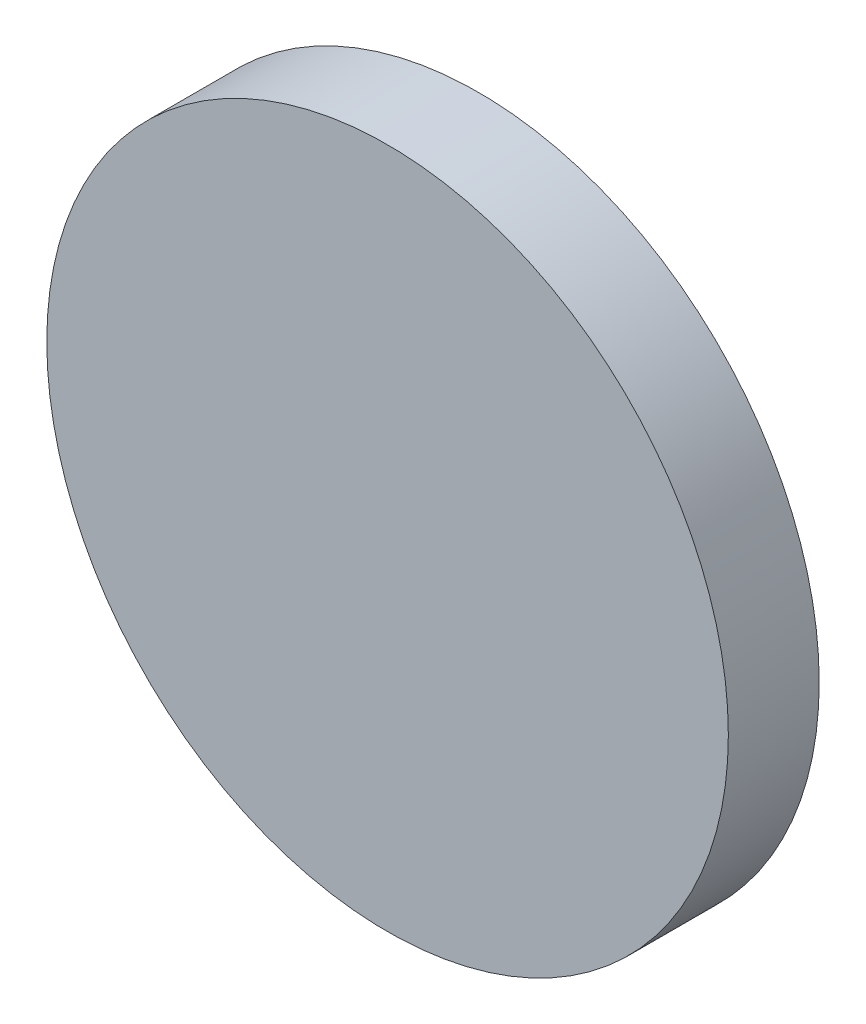
ISO-10303-21;
HEADER;
FILE_DESCRIPTION(('STEP AP214'),'2;1');
FILE_NAME('part.step','',(''),(''),'','','');
FILE_SCHEMA(('AUTOMOTIVE_DESIGN { 1 0 10303 214 1 1 1 1 }'));
ENDSEC;
DATA;
#1=APPLICATION_CONTEXT('core data for automotive mechanical design processes');
#2=APPLICATION_PROTOCOL_DEFINITION('international standard','automotive_design',2000,#1);
#3=PRODUCT_CONTEXT('',#1,'mechanical');
#4=PRODUCT('Part','Part','',(#3));
#5=PRODUCT_RELATED_PRODUCT_CATEGORY('part','',(#4));
#6=PRODUCT_DEFINITION_FORMATION('','',#4);
#7=PRODUCT_DEFINITION_CONTEXT('part definition',#1,'design');
#8=PRODUCT_DEFINITION('design','',#6,#7);
#9=PRODUCT_DEFINITION_SHAPE('','',#8);
#10=(LENGTH_UNIT() NAMED_UNIT(*) SI_UNIT(.MILLI.,.METRE.));
#11=(NAMED_UNIT(*) PLANE_ANGLE_UNIT() SI_UNIT($,.RADIAN.));
#12=(NAMED_UNIT(*) SI_UNIT($,.STERADIAN.) SOLID_ANGLE_UNIT());
#13=UNCERTAINTY_MEASURE_WITH_UNIT(LENGTH_MEASURE(1.E-05),#10,'distance_accuracy_value','');
#14=(GEOMETRIC_REPRESENTATION_CONTEXT(3) GLOBAL_UNCERTAINTY_ASSIGNED_CONTEXT((#13)) GLOBAL_UNIT_ASSIGNED_CONTEXT((#10,
#11,#12)) REPRESENTATION_CONTEXT('',''));
#15=CARTESIAN_POINT('',(0.,0.,0.));
#16=DIRECTION('',(0.,0.,1.));
#17=DIRECTION('',(1.,0.,0.));
#18=AXIS2_PLACEMENT_3D('',#15,#16,#17);
#19=CARTESIAN_POINT('',(0.,0.,4.));
#20=DIRECTION('',(0.,0.,-1.));
#21=DIRECTION('',(-1.,0.,0.));
#22=AXIS2_PLACEMENT_3D('',#19,#20,#21);
#23=CYLINDRICAL_SURFACE('',#22,15.);
#24=CARTESIAN_POINT('',(0.,0.,4.));
#25=DIRECTION('',(0.,0.,1.));
#26=DIRECTION('',(1.,0.,0.));
#27=AXIS2_PLACEMENT_3D('',#24,#25,#26);
#28=CIRCLE('',#27,15.);
#29=CARTESIAN_POINT('',(15.,0.,4.));
#30=VERTEX_POINT('',#29);
#31=EDGE_CURVE('E10',#30,#30,#28,.T.);
#32=ORIENTED_EDGE('',*,*,#31,.F.);
#33=EDGE_LOOP('',(#32));
#34=FACE_BOUND('',#33,.T.);
#35=CARTESIAN_POINT('',(0.,0.,0.));
#36=DIRECTION('',(0.,0.,1.));
#37=DIRECTION('',(1.,0.,0.));
#38=AXIS2_PLACEMENT_3D('',#35,#36,#37);
#39=CIRCLE('',#38,15.);
#40=CARTESIAN_POINT('',(15.,0.,0.));
#41=VERTEX_POINT('',#40);
#42=EDGE_CURVE('E38',#41,#41,#39,.T.);
#43=ORIENTED_EDGE('',*,*,#42,.T.);
#44=EDGE_LOOP('',(#43));
#45=FACE_BOUND('',#44,.T.);
#46=ADVANCED_FACE('F35',(#34,#45),#23,.T.);
#47=CARTESIAN_POINT('',(0.,0.,4.));
#48=DIRECTION('',(0.,0.,1.));
#49=DIRECTION('',(1.,0.,0.));
#50=AXIS2_PLACEMENT_3D('',#47,#48,#49);
#51=PLANE('',#50);
#52=ORIENTED_EDGE('',*,*,#31,.T.);
#53=EDGE_LOOP('',(#52));
#54=FACE_BOUND('',#53,.T.);
#55=ADVANCED_FACE('F50',(#54),#51,.T.);
#56=CARTESIAN_POINT('',(0.,0.,0.));
#57=DIRECTION('',(0.,0.,1.));
#58=DIRECTION('',(1.,0.,0.));
#59=AXIS2_PLACEMENT_3D('',#56,#57,#58);
#60=PLANE('',#59);
#61=ORIENTED_EDGE('',*,*,#42,.F.);
#62=EDGE_LOOP('',(#61));
#63=FACE_BOUND('',#62,.T.);
#64=ADVANCED_FACE('F48',(#63),#60,.F.);
#65=CLOSED_SHELL('',(#46,#55,#64));
#66=MANIFOLD_SOLID_BREP('B2',#65);
#67=ADVANCED_BREP_SHAPE_REPRESENTATION('',(#18,#66),#14);
#68=SHAPE_DEFINITION_REPRESENTATION(#9,#67);
ENDSEC;
END-ISO-10303-21;
